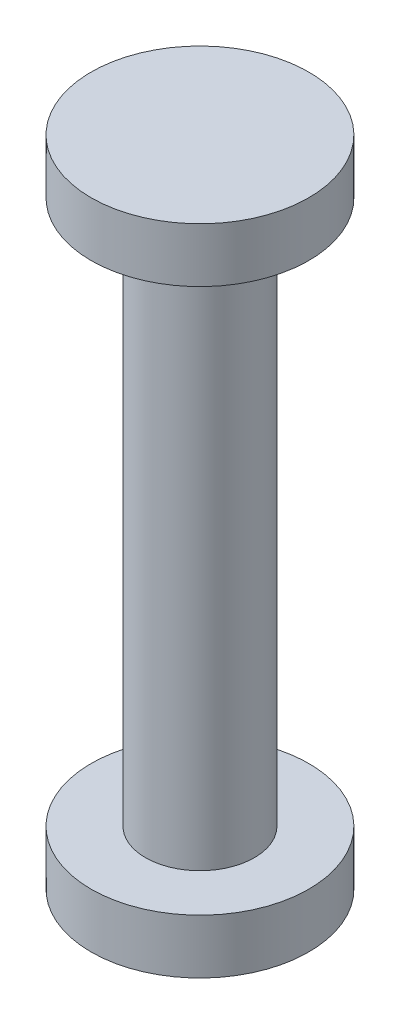
ISO-10303-21;
HEADER;
FILE_DESCRIPTION(('STEP AP214'),'2;1');
FILE_NAME('part.step','',(''),(''),'','','');
FILE_SCHEMA(('AUTOMOTIVE_DESIGN { 1 0 10303 214 1 1 1 1 }'));
ENDSEC;
DATA;
#1=APPLICATION_CONTEXT('core data for automotive mechanical design processes');
#2=APPLICATION_PROTOCOL_DEFINITION('international standard','automotive_design',2000,#1);
#3=PRODUCT_CONTEXT('',#1,'mechanical');
#4=PRODUCT('Part','Part','',(#3));
#5=PRODUCT_RELATED_PRODUCT_CATEGORY('part','',(#4));
#6=PRODUCT_DEFINITION_FORMATION('','',#4);
#7=PRODUCT_DEFINITION_CONTEXT('part definition',#1,'design');
#8=PRODUCT_DEFINITION('design','',#6,#7);
#9=PRODUCT_DEFINITION_SHAPE('','',#8);
#10=(LENGTH_UNIT() NAMED_UNIT(*) SI_UNIT(.MILLI.,.METRE.));
#11=(NAMED_UNIT(*) PLANE_ANGLE_UNIT() SI_UNIT($,.RADIAN.));
#12=(NAMED_UNIT(*) SI_UNIT($,.STERADIAN.) SOLID_ANGLE_UNIT());
#13=UNCERTAINTY_MEASURE_WITH_UNIT(LENGTH_MEASURE(1.E-05),#10,'distance_accuracy_value','');
#14=(GEOMETRIC_REPRESENTATION_CONTEXT(3) GLOBAL_UNCERTAINTY_ASSIGNED_CONTEXT((#13)) GLOBAL_UNIT_ASSIGNED_CONTEXT((#10,
#11,#12)) REPRESENTATION_CONTEXT('',''));
#15=CARTESIAN_POINT('',(0.,0.,0.));
#16=DIRECTION('',(0.,0.,1.));
#17=DIRECTION('',(1.,0.,0.));
#18=AXIS2_PLACEMENT_3D('',#15,#16,#17);
#19=CARTESIAN_POINT('',(0.,50.,0.));
#20=DIRECTION('',(0.,-1.,0.));
#21=DIRECTION('',(0.,0.,-1.));
#22=AXIS2_PLACEMENT_3D('',#19,#20,#21);
#23=CYLINDRICAL_SURFACE('',#22,5.);
#24=CARTESIAN_POINT('',(0.,50.,0.));
#25=DIRECTION('',(0.,1.,0.));
#26=DIRECTION('',(0.,0.,1.));
#27=AXIS2_PLACEMENT_3D('',#24,#25,#26);
#28=CIRCLE('',#27,5.);
#29=CARTESIAN_POINT('',(0.,50.,5.));
#30=VERTEX_POINT('',#29);
#31=EDGE_CURVE('E10',#30,#30,#28,.T.);
#32=ORIENTED_EDGE('',*,*,#31,.F.);
#33=EDGE_LOOP('',(#32));
#34=FACE_BOUND('',#33,.T.);
#35=CARTESIAN_POINT('',(0.,0.,0.));
#36=DIRECTION('',(0.,1.,0.));
#37=DIRECTION('',(0.,0.,1.));
#38=AXIS2_PLACEMENT_3D('',#35,#36,#37);
#39=CIRCLE('',#38,5.);
#40=CARTESIAN_POINT('',(0.,0.,5.));
#41=VERTEX_POINT('',#40);
#42=EDGE_CURVE('E40',#41,#41,#39,.T.);
#43=ORIENTED_EDGE('',*,*,#42,.T.);
#44=EDGE_LOOP('',(#43));
#45=FACE_BOUND('',#44,.T.);
#46=ADVANCED_FACE('F37',(#34,#45),#23,.T.);
#47=CARTESIAN_POINT('',(0.,55.,0.));
#48=DIRECTION('',(0.,-1.,0.));
#49=DIRECTION('',(0.,0.,-1.));
#50=AXIS2_PLACEMENT_3D('',#47,#48,#49);
#51=CYLINDRICAL_SURFACE('',#50,10.);
#52=CARTESIAN_POINT('',(0.,55.,0.));
#53=DIRECTION('',(0.,1.,0.));
#54=DIRECTION('',(0.,0.,1.));
#55=AXIS2_PLACEMENT_3D('',#52,#53,#54);
#56=CIRCLE('',#55,10.);
#57=CARTESIAN_POINT('',(0.,55.,10.));
#58=VERTEX_POINT('',#57);
#59=EDGE_CURVE('E45',#58,#58,#56,.T.);
#60=ORIENTED_EDGE('',*,*,#59,.F.);
#61=EDGE_LOOP('',(#60));
#62=FACE_BOUND('',#61,.T.);
#63=CARTESIAN_POINT('',(0.,50.,0.));
#64=DIRECTION('',(0.,1.,0.));
#65=DIRECTION('',(0.,0.,1.));
#66=AXIS2_PLACEMENT_3D('',#63,#64,#65);
#67=CIRCLE('',#66,10.);
#68=CARTESIAN_POINT('',(0.,50.,10.));
#69=VERTEX_POINT('',#68);
#70=EDGE_CURVE('E50',#69,#69,#67,.T.);
#71=ORIENTED_EDGE('',*,*,#70,.T.);
#72=EDGE_LOOP('',(#71));
#73=FACE_BOUND('',#72,.T.);
#74=ADVANCED_FACE('F91',(#62,#73),#51,.T.);
#75=CARTESIAN_POINT('',(0.,55.,0.));
#76=DIRECTION('',(0.,1.,0.));
#77=DIRECTION('',(0.,0.,1.));
#78=AXIS2_PLACEMENT_3D('',#75,#76,#77);
#79=PLANE('',#78);
#80=ORIENTED_EDGE('',*,*,#59,.T.);
#81=EDGE_LOOP('',(#80));
#82=FACE_BOUND('',#81,.T.);
#83=ADVANCED_FACE('F87',(#82),#79,.T.);
#84=CARTESIAN_POINT('',(0.,50.,0.));
#85=DIRECTION('',(0.,1.,0.));
#86=DIRECTION('',(0.,0.,1.));
#87=AXIS2_PLACEMENT_3D('',#84,#85,#86);
#88=PLANE('',#87);
#89=ORIENTED_EDGE('',*,*,#31,.T.);
#90=EDGE_LOOP('',(#89));
#91=FACE_BOUND('',#90,.T.);
#92=ORIENTED_EDGE('',*,*,#70,.F.);
#93=EDGE_LOOP('',(#92));
#94=FACE_BOUND('',#93,.T.);
#95=ADVANCED_FACE('F79',(#91,#94),#88,.F.);
#96=CARTESIAN_POINT('',(0.,-5.,0.));
#97=DIRECTION('',(0.,1.,0.));
#98=DIRECTION('',(0.,0.,1.));
#99=AXIS2_PLACEMENT_3D('',#96,#97,#98);
#100=CYLINDRICAL_SURFACE('',#99,10.);
#101=CARTESIAN_POINT('',(0.,-5.,0.));
#102=DIRECTION('',(0.,1.,0.));
#103=DIRECTION('',(0.,0.,1.));
#104=AXIS2_PLACEMENT_3D('',#101,#102,#103);
#105=CIRCLE('',#104,10.);
#106=CARTESIAN_POINT('',(0.,-5.,10.));
#107=VERTEX_POINT('',#106);
#108=EDGE_CURVE('E60',#107,#107,#105,.T.);
#109=ORIENTED_EDGE('',*,*,#108,.T.);
#110=EDGE_LOOP('',(#109));
#111=FACE_BOUND('',#110,.T.);
#112=CARTESIAN_POINT('',(0.,0.,0.));
#113=DIRECTION('',(0.,1.,0.));
#114=DIRECTION('',(0.,0.,1.));
#115=AXIS2_PLACEMENT_3D('',#112,#113,#114);
#116=CIRCLE('',#115,10.);
#117=CARTESIAN_POINT('',(0.,0.,10.));
#118=VERTEX_POINT('',#117);
#119=EDGE_CURVE('E56',#118,#118,#116,.T.);
#120=ORIENTED_EDGE('',*,*,#119,.F.);
#121=EDGE_LOOP('',(#120));
#122=FACE_BOUND('',#121,.T.);
#123=ADVANCED_FACE('F77',(#111,#122),#100,.T.);
#124=CARTESIAN_POINT('',(0.,-5.,0.));
#125=DIRECTION('',(0.,-1.,0.));
#126=DIRECTION('',(0.,0.,1.));
#127=AXIS2_PLACEMENT_3D('',#124,#125,#126);
#128=PLANE('',#127);
#129=ORIENTED_EDGE('',*,*,#108,.F.);
#130=EDGE_LOOP('',(#129));
#131=FACE_BOUND('',#130,.T.);
#132=ADVANCED_FACE('F73',(#131),#128,.T.);
#133=CARTESIAN_POINT('',(0.,0.,0.));
#134=DIRECTION('',(0.,-1.,0.));
#135=DIRECTION('',(0.,0.,1.));
#136=AXIS2_PLACEMENT_3D('',#133,#134,#135);
#137=PLANE('',#136);
#138=ORIENTED_EDGE('',*,*,#42,.F.);
#139=EDGE_LOOP('',(#138));
#140=FACE_BOUND('',#139,.T.);
#141=ORIENTED_EDGE('',*,*,#119,.T.);
#142=EDGE_LOOP('',(#141));
#143=FACE_BOUND('',#142,.T.);
#144=ADVANCED_FACE('F70',(#140,#143),#137,.F.);
#145=CLOSED_SHELL('',(#46,#74,#83,#95,#123,#132,#144));
#146=MANIFOLD_SOLID_BREP('B2',#145);
#147=ADVANCED_BREP_SHAPE_REPRESENTATION('',(#18,#146),#14);
#148=SHAPE_DEFINITION_REPRESENTATION(#9,#147);
ENDSEC;
END-ISO-10303-21;
